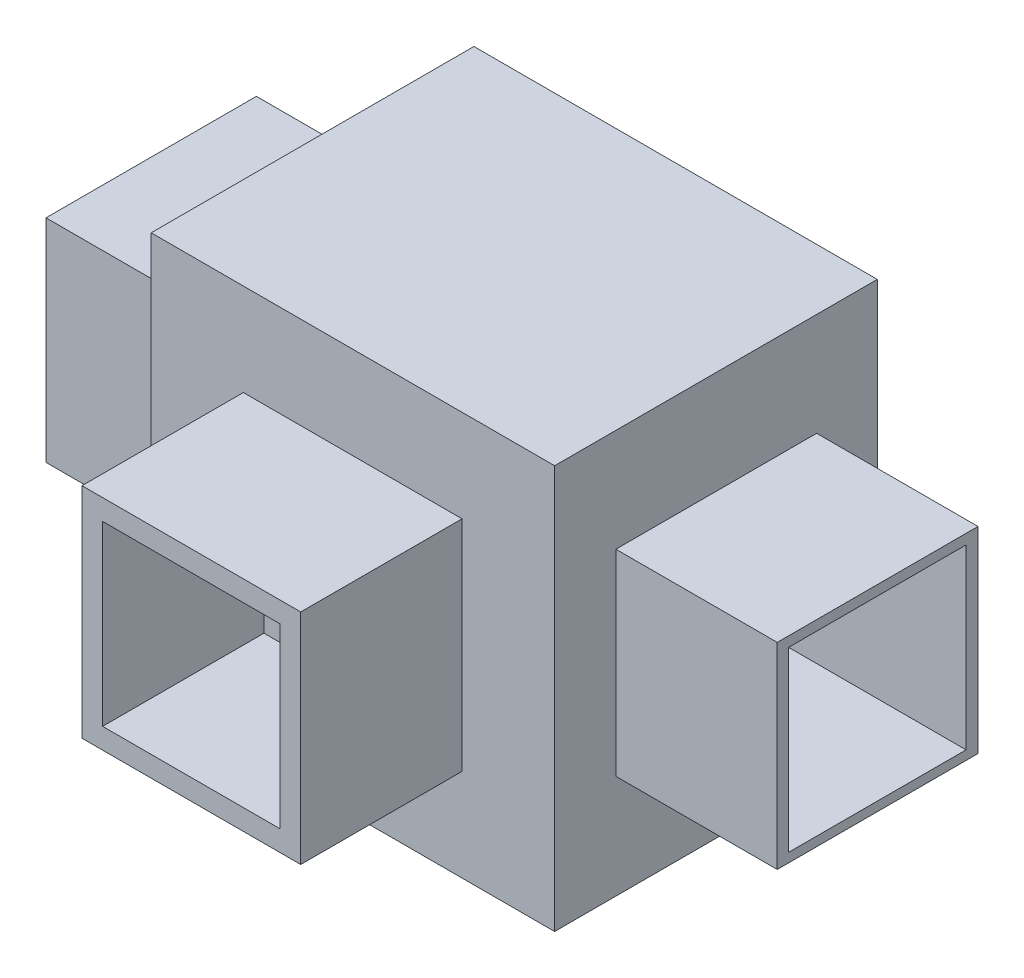
ISO-10303-21;
HEADER;
FILE_DESCRIPTION(('STEP AP214'),'2;1');
FILE_NAME('part.step','',(''),(''),'','','');
FILE_SCHEMA(('AUTOMOTIVE_DESIGN { 1 0 10303 214 1 1 1 1 }'));
ENDSEC;
DATA;
#1=APPLICATION_CONTEXT('core data for automotive mechanical design processes');
#2=APPLICATION_PROTOCOL_DEFINITION('international standard','automotive_design',2000,#1);
#3=PRODUCT_CONTEXT('',#1,'mechanical');
#4=PRODUCT('Part','Part','',(#3));
#5=PRODUCT_RELATED_PRODUCT_CATEGORY('part','',(#4));
#6=PRODUCT_DEFINITION_FORMATION('','',#4);
#7=PRODUCT_DEFINITION_CONTEXT('part definition',#1,'design');
#8=PRODUCT_DEFINITION('design','',#6,#7);
#9=PRODUCT_DEFINITION_SHAPE('','',#8);
#10=(LENGTH_UNIT() NAMED_UNIT(*) SI_UNIT(.MILLI.,.METRE.));
#11=(NAMED_UNIT(*) PLANE_ANGLE_UNIT() SI_UNIT($,.RADIAN.));
#12=(NAMED_UNIT(*) SI_UNIT($,.STERADIAN.) SOLID_ANGLE_UNIT());
#13=UNCERTAINTY_MEASURE_WITH_UNIT(LENGTH_MEASURE(1.E-05),#10,'distance_accuracy_value','');
#14=(GEOMETRIC_REPRESENTATION_CONTEXT(3) GLOBAL_UNCERTAINTY_ASSIGNED_CONTEXT((#13)) GLOBAL_UNIT_ASSIGNED_CONTEXT((#10,
#11,#12)) REPRESENTATION_CONTEXT('',''));
#15=CARTESIAN_POINT('',(0.,0.,0.));
#16=DIRECTION('',(0.,0.,1.));
#17=DIRECTION('',(1.,0.,0.));
#18=AXIS2_PLACEMENT_3D('',#15,#16,#17);
#19=CARTESIAN_POINT('',(-31.2466038441036,21.3932934700663,20.));
#20=DIRECTION('',(-1.,0.,0.));
#21=DIRECTION('',(0.,-1.,0.));
#22=AXIS2_PLACEMENT_3D('',#19,#20,#21);
#23=PLANE('',#22);
#24=DIRECTION('',(0.,0.,-1.));
#25=VECTOR('',#24,1.);
#26=CARTESIAN_POINT('',(-31.2466038441036,-28.6067065299337,20.));
#27=LINE('',#26,#25);
#28=CARTESIAN_POINT('',(-31.2466038441036,-28.6067065299337,20.));
#29=VERTEX_POINT('',#28);
#30=CARTESIAN_POINT('',(-31.2466038441036,-28.6067065299337,-20.));
#31=VERTEX_POINT('',#30);
#32=EDGE_CURVE('E41',#29,#31,#27,.T.);
#33=ORIENTED_EDGE('',*,*,#32,.T.);
#34=DIRECTION('',(0.,-1.,0.));
#35=VECTOR('',#34,1.);
#36=CARTESIAN_POINT('',(-31.2466038441036,21.3932934700663,-20.));
#37=LINE('',#36,#35);
#38=CARTESIAN_POINT('',(-31.2466038441036,21.3932934700663,-20.));
#39=VERTEX_POINT('',#38);
#40=EDGE_CURVE('E293',#39,#31,#37,.T.);
#41=ORIENTED_EDGE('',*,*,#40,.F.);
#42=DIRECTION('',(0.,0.,-1.));
#43=VECTOR('',#42,1.);
#44=CARTESIAN_POINT('',(-31.2466038441036,21.3932934700663,20.));
#45=LINE('',#44,#43);
#46=CARTESIAN_POINT('',(-31.2466038441036,21.3932934700663,20.));
#47=VERTEX_POINT('',#46);
#48=EDGE_CURVE('E374',#47,#39,#45,.T.);
#49=ORIENTED_EDGE('',*,*,#48,.F.);
#50=DIRECTION('',(0.,1.,0.));
#51=VECTOR('',#50,1.);
#52=CARTESIAN_POINT('',(-31.2466038441036,21.3932934700663,20.));
#53=LINE('',#52,#51);
#54=EDGE_CURVE('E368',#29,#47,#53,.T.);
#55=ORIENTED_EDGE('',*,*,#54,.F.);
#56=EDGE_LOOP('',(#33,#41,#49,#55));
#57=FACE_BOUND('',#56,.T.);
#58=DIRECTION('',(0.,-1.,0.));
#59=VECTOR('',#58,1.);
#60=CARTESIAN_POINT('',(-31.2466038441036,8.6331538324913,12.4057740013086));
#61=LINE('',#60,#59);
#62=CARTESIAN_POINT('',(-31.2466038441036,8.6331538324913,12.4057740013086));
#63=VERTEX_POINT('',#62);
#64=CARTESIAN_POINT('',(-31.2466038441036,-15.7456788712302,12.4057740013086));
#65=VERTEX_POINT('',#64);
#66=EDGE_CURVE('E220',#63,#65,#61,.T.);
#67=ORIENTED_EDGE('',*,*,#66,.F.);
#68=DIRECTION('',(0.,0.,1.));
#69=VECTOR('',#68,1.);
#70=CARTESIAN_POINT('',(-31.2466038441036,8.6331538324913,12.4057740013086));
#71=LINE('',#70,#69);
#72=CARTESIAN_POINT('',(-31.2466038441036,8.6331538324913,-12.47859569947));
#73=VERTEX_POINT('',#72);
#74=EDGE_CURVE('E225',#73,#63,#71,.T.);
#75=ORIENTED_EDGE('',*,*,#74,.F.);
#76=DIRECTION('',(0.,1.,0.));
#77=VECTOR('',#76,1.);
#78=CARTESIAN_POINT('',(-31.2466038441036,8.6331538324913,-12.47859569947));
#79=LINE('',#78,#77);
#80=CARTESIAN_POINT('',(-31.2466038441036,-15.7456788712302,-12.47859569947));
#81=VERTEX_POINT('',#80);
#82=EDGE_CURVE('E53',#81,#73,#79,.T.);
#83=ORIENTED_EDGE('',*,*,#82,.F.);
#84=DIRECTION('',(0.,0.,-1.));
#85=VECTOR('',#84,1.);
#86=CARTESIAN_POINT('',(-31.2466038441036,-15.7456788712302,12.4057740013086));
#87=LINE('',#86,#85);
#88=EDGE_CURVE('E48',#65,#81,#87,.T.);
#89=ORIENTED_EDGE('',*,*,#88,.F.);
#90=EDGE_LOOP('',(#67,#75,#83,#89));
#91=FACE_BOUND('',#90,.T.);
#92=ADVANCED_FACE('F33',(#57,#91),#23,.F.);
#93=CARTESIAN_POINT('',(-81.2466038441036,21.3932934700663,20.));
#94=DIRECTION('',(1.,0.,0.));
#95=DIRECTION('',(0.,0.,-1.));
#96=AXIS2_PLACEMENT_3D('',#93,#94,#95);
#97=PLANE('',#96);
#98=DIRECTION('',(0.,0.,-1.));
#99=VECTOR('',#98,1.);
#100=CARTESIAN_POINT('',(-81.2466038441036,21.3932934700663,20.));
#101=LINE('',#100,#99);
#102=CARTESIAN_POINT('',(-81.2466038441036,21.3932934700663,20.));
#103=VERTEX_POINT('',#102);
#104=CARTESIAN_POINT('',(-81.2466038441036,21.3932934700663,-20.));
#105=VERTEX_POINT('',#104);
#106=EDGE_CURVE('E372',#103,#105,#101,.T.);
#107=ORIENTED_EDGE('',*,*,#106,.T.);
#108=DIRECTION('',(0.,1.,0.));
#109=VECTOR('',#108,1.);
#110=CARTESIAN_POINT('',(-81.2466038441036,21.3932934700663,-20.));
#111=LINE('',#110,#109);
#112=CARTESIAN_POINT('',(-81.2466038441036,-28.6067065299337,-20.));
#113=VERTEX_POINT('',#112);
#114=EDGE_CURVE('E299',#113,#105,#111,.T.);
#115=ORIENTED_EDGE('',*,*,#114,.F.);
#116=DIRECTION('',(0.,0.,-1.));
#117=VECTOR('',#116,1.);
#118=CARTESIAN_POINT('',(-81.2466038441036,-28.6067065299337,20.));
#119=LINE('',#118,#117);
#120=CARTESIAN_POINT('',(-81.2466038441036,-28.6067065299337,20.));
#121=VERTEX_POINT('',#120);
#122=EDGE_CURVE('E11',#121,#113,#119,.T.);
#123=ORIENTED_EDGE('',*,*,#122,.F.);
#124=DIRECTION('',(0.,-1.,0.));
#125=VECTOR('',#124,1.);
#126=CARTESIAN_POINT('',(-81.2466038441036,21.3932934700663,20.));
#127=LINE('',#126,#125);
#128=EDGE_CURVE('E363',#103,#121,#127,.T.);
#129=ORIENTED_EDGE('',*,*,#128,.F.);
#130=EDGE_LOOP('',(#107,#115,#123,#129));
#131=FACE_BOUND('',#130,.T.);
#132=DIRECTION('',(0.,1.,0.));
#133=VECTOR('',#132,1.);
#134=CARTESIAN_POINT('',(-81.2466038441036,9.52314430911532,13.0390923407262));
#135=LINE('',#134,#133);
#136=CARTESIAN_POINT('',(-81.2466038441036,-16.7365573689828,13.0390923407262));
#137=VERTEX_POINT('',#136);
#138=CARTESIAN_POINT('',(-81.2466038441036,9.52314430911532,13.0390923407262));
#139=VERTEX_POINT('',#138);
#140=EDGE_CURVE('E260',#137,#139,#135,.T.);
#141=ORIENTED_EDGE('',*,*,#140,.F.);
#142=DIRECTION('',(0.,0.,1.));
#143=VECTOR('',#142,1.);
#144=CARTESIAN_POINT('',(-81.2466038441036,-16.7365573689828,-13.0390923407262));
#145=LINE('',#144,#143);
#146=CARTESIAN_POINT('',(-81.2466038441036,-16.7365573689828,-13.0390923407262));
#147=VERTEX_POINT('',#146);
#148=EDGE_CURVE('E265',#147,#137,#145,.T.);
#149=ORIENTED_EDGE('',*,*,#148,.F.);
#150=DIRECTION('',(0.,-1.,0.));
#151=VECTOR('',#150,1.);
#152=CARTESIAN_POINT('',(-81.2466038441036,9.52314430911532,-13.0390923407262));
#153=LINE('',#152,#151);
#154=CARTESIAN_POINT('',(-81.2466038441036,9.52314430911532,-13.0390923407262));
#155=VERTEX_POINT('',#154);
#156=EDGE_CURVE('E277',#155,#147,#153,.T.);
#157=ORIENTED_EDGE('',*,*,#156,.F.);
#158=DIRECTION('',(0.,0.,-1.));
#159=VECTOR('',#158,1.);
#160=CARTESIAN_POINT('',(-81.2466038441036,9.52314430911532,-13.0390923407262));
#161=LINE('',#160,#159);
#162=EDGE_CURVE('E274',#139,#155,#161,.T.);
#163=ORIENTED_EDGE('',*,*,#162,.F.);
#164=EDGE_LOOP('',(#141,#149,#157,#163));
#165=FACE_BOUND('',#164,.T.);
#166=ADVANCED_FACE('F35',(#131,#165),#97,.F.);
#167=CARTESIAN_POINT('',(0.,0.,20.));
#168=DIRECTION('',(0.,0.,1.));
#169=DIRECTION('',(1.,0.,0.));
#170=AXIS2_PLACEMENT_3D('',#167,#168,#169);
#171=PLANE('',#170);
#172=ORIENTED_EDGE('',*,*,#128,.T.);
#173=DIRECTION('',(1.,0.,0.));
#174=VECTOR('',#173,1.);
#175=CARTESIAN_POINT('',(-81.2466038441036,-28.6067065299337,20.));
#176=LINE('',#175,#174);
#177=EDGE_CURVE('E366',#121,#29,#176,.T.);
#178=ORIENTED_EDGE('',*,*,#177,.T.);
#179=ORIENTED_EDGE('',*,*,#54,.T.);
#180=DIRECTION('',(-1.,0.,0.));
#181=VECTOR('',#180,1.);
#182=CARTESIAN_POINT('',(-81.2466038441036,21.3932934700663,20.));
#183=LINE('',#182,#181);
#184=EDGE_CURVE('E370',#47,#103,#183,.T.);
#185=ORIENTED_EDGE('',*,*,#184,.T.);
#186=EDGE_LOOP('',(#172,#178,#179,#185));
#187=FACE_BOUND('',#186,.T.);
#188=DIRECTION('',(-1.,0.,0.));
#189=VECTOR('',#188,1.);
#190=CARTESIAN_POINT('',(-69.8249239257988,9.96044253707693,20.));
#191=LINE('',#190,#189);
#192=CARTESIAN_POINT('',(-42.7146356064686,9.96044253707693,20.));
#193=VERTEX_POINT('',#192);
#194=CARTESIAN_POINT('',(-69.8249239257988,9.96044253707693,20.));
#195=VERTEX_POINT('',#194);
#196=EDGE_CURVE('E348',#193,#195,#191,.T.);
#197=ORIENTED_EDGE('',*,*,#196,.F.);
#198=DIRECTION('',(0.,1.,0.));
#199=VECTOR('',#198,1.);
#200=CARTESIAN_POINT('',(-42.7146356064686,9.96044253707693,20.));
#201=LINE('',#200,#199);
#202=CARTESIAN_POINT('',(-42.7146356064686,-17.1498457822532,20.));
#203=VERTEX_POINT('',#202);
#204=EDGE_CURVE('E334',#203,#193,#201,.T.);
#205=ORIENTED_EDGE('',*,*,#204,.F.);
#206=DIRECTION('',(1.,0.,0.));
#207=VECTOR('',#206,1.);
#208=CARTESIAN_POINT('',(-69.8249239257988,-17.1498457822532,20.));
#209=LINE('',#208,#207);
#210=CARTESIAN_POINT('',(-69.8249239257988,-17.1498457822532,20.));
#211=VERTEX_POINT('',#210);
#212=EDGE_CURVE('E339',#211,#203,#209,.T.);
#213=ORIENTED_EDGE('',*,*,#212,.F.);
#214=DIRECTION('',(0.,-1.,0.));
#215=VECTOR('',#214,1.);
#216=CARTESIAN_POINT('',(-69.8249239257988,9.96044253707693,20.));
#217=LINE('',#216,#215);
#218=EDGE_CURVE('E350',#195,#211,#217,.T.);
#219=ORIENTED_EDGE('',*,*,#218,.F.);
#220=EDGE_LOOP('',(#197,#205,#213,#219));
#221=FACE_BOUND('',#220,.T.);
#222=ADVANCED_FACE('F394',(#187,#221),#171,.T.);
#223=CARTESIAN_POINT('',(-81.2466038441036,-28.6067065299337,20.));
#224=DIRECTION('',(0.,1.,0.));
#225=DIRECTION('',(0.,0.,1.));
#226=AXIS2_PLACEMENT_3D('',#223,#224,#225);
#227=PLANE('',#226);
#228=ORIENTED_EDGE('',*,*,#122,.T.);
#229=DIRECTION('',(-1.,0.,0.));
#230=VECTOR('',#229,1.);
#231=CARTESIAN_POINT('',(-31.2466038441036,-28.6067065299337,-20.));
#232=LINE('',#231,#230);
#233=EDGE_CURVE('E296',#31,#113,#232,.T.);
#234=ORIENTED_EDGE('',*,*,#233,.F.);
#235=ORIENTED_EDGE('',*,*,#32,.F.);
#236=ORIENTED_EDGE('',*,*,#177,.F.);
#237=EDGE_LOOP('',(#228,#234,#235,#236));
#238=FACE_BOUND('',#237,.T.);
#239=ADVANCED_FACE('F382',(#238),#227,.F.);
#240=CARTESIAN_POINT('',(-81.2466038441036,21.3932934700663,20.));
#241=DIRECTION('',(0.,-1.,0.));
#242=DIRECTION('',(0.,0.,-1.));
#243=AXIS2_PLACEMENT_3D('',#240,#241,#242);
#244=PLANE('',#243);
#245=ORIENTED_EDGE('',*,*,#48,.T.);
#246=DIRECTION('',(1.,0.,0.));
#247=VECTOR('',#246,1.);
#248=CARTESIAN_POINT('',(-31.2466038441036,21.3932934700663,-20.));
#249=LINE('',#248,#247);
#250=EDGE_CURVE('E302',#105,#39,#249,.T.);
#251=ORIENTED_EDGE('',*,*,#250,.F.);
#252=ORIENTED_EDGE('',*,*,#106,.F.);
#253=ORIENTED_EDGE('',*,*,#184,.F.);
#254=EDGE_LOOP('',(#245,#251,#252,#253));
#255=FACE_BOUND('',#254,.T.);
#256=ADVANCED_FACE('F390',(#255),#244,.F.);
#257=CARTESIAN_POINT('',(0.,0.,40.));
#258=DIRECTION('',(0.,0.,1.));
#259=DIRECTION('',(1.,0.,0.));
#260=AXIS2_PLACEMENT_3D('',#257,#258,#259);
#261=PLANE('',#260);
#262=DIRECTION('',(0.,1.,0.));
#263=VECTOR('',#262,1.);
#264=CARTESIAN_POINT('',(-42.7146356064686,9.96044253707693,40.));
#265=LINE('',#264,#263);
#266=CARTESIAN_POINT('',(-42.7146356064686,-17.1498457822532,40.));
#267=VERTEX_POINT('',#266);
#268=CARTESIAN_POINT('',(-42.7146356064686,9.96044253707693,40.));
#269=VERTEX_POINT('',#268);
#270=EDGE_CURVE('E335',#267,#269,#265,.T.);
#271=ORIENTED_EDGE('',*,*,#270,.T.);
#272=DIRECTION('',(-1.,0.,0.));
#273=VECTOR('',#272,1.);
#274=CARTESIAN_POINT('',(-69.8249239257988,9.96044253707693,40.));
#275=LINE('',#274,#273);
#276=CARTESIAN_POINT('',(-69.8249239257988,9.96044253707693,40.));
#277=VERTEX_POINT('',#276);
#278=EDGE_CURVE('E338',#269,#277,#275,.T.);
#279=ORIENTED_EDGE('',*,*,#278,.T.);
#280=DIRECTION('',(0.,-1.,0.));
#281=VECTOR('',#280,1.);
#282=CARTESIAN_POINT('',(-69.8249239257988,9.96044253707693,40.));
#283=LINE('',#282,#281);
#284=CARTESIAN_POINT('',(-69.8249239257988,-17.1498457822532,40.));
#285=VERTEX_POINT('',#284);
#286=EDGE_CURVE('E341',#277,#285,#283,.T.);
#287=ORIENTED_EDGE('',*,*,#286,.T.);
#288=DIRECTION('',(1.,0.,0.));
#289=VECTOR('',#288,1.);
#290=CARTESIAN_POINT('',(-69.8249239257988,-17.1498457822532,40.));
#291=LINE('',#290,#289);
#292=EDGE_CURVE('E343',#285,#267,#291,.T.);
#293=ORIENTED_EDGE('',*,*,#292,.T.);
#294=EDGE_LOOP('',(#271,#279,#287,#293));
#295=FACE_BOUND('',#294,.T.);
#296=DIRECTION('',(-1.,0.,0.));
#297=VECTOR('',#296,1.);
#298=CARTESIAN_POINT('',(-67.2697797661337,7.40529837741184,40.));
#299=LINE('',#298,#297);
#300=CARTESIAN_POINT('',(-45.2697797661337,7.40529837741185,40.));
#301=VERTEX_POINT('',#300);
#302=CARTESIAN_POINT('',(-67.2697797661337,7.40529837741184,40.));
#303=VERTEX_POINT('',#302);
#304=EDGE_CURVE('E308',#301,#303,#299,.T.);
#305=ORIENTED_EDGE('',*,*,#304,.F.);
#306=DIRECTION('',(0.,1.,0.));
#307=VECTOR('',#306,1.);
#308=CARTESIAN_POINT('',(-45.2697797661337,7.40529837741185,40.));
#309=LINE('',#308,#307);
#310=CARTESIAN_POINT('',(-45.2697797661337,-14.5947016225882,40.));
#311=VERTEX_POINT('',#310);
#312=EDGE_CURVE('E306',#311,#301,#309,.T.);
#313=ORIENTED_EDGE('',*,*,#312,.F.);
#314=DIRECTION('',(1.,0.,0.));
#315=VECTOR('',#314,1.);
#316=CARTESIAN_POINT('',(-67.2697797661337,-14.5947016225882,40.));
#317=LINE('',#316,#315);
#318=CARTESIAN_POINT('',(-67.2697797661337,-14.5947016225882,40.));
#319=VERTEX_POINT('',#318);
#320=EDGE_CURVE('E314',#319,#311,#317,.T.);
#321=ORIENTED_EDGE('',*,*,#320,.F.);
#322=DIRECTION('',(0.,-1.,0.));
#323=VECTOR('',#322,1.);
#324=CARTESIAN_POINT('',(-67.2697797661337,7.40529837741184,40.));
#325=LINE('',#324,#323);
#326=EDGE_CURVE('E311',#303,#319,#325,.T.);
#327=ORIENTED_EDGE('',*,*,#326,.F.);
#328=EDGE_LOOP('',(#305,#313,#321,#327));
#329=FACE_BOUND('',#328,.T.);
#330=ADVANCED_FACE('F436',(#295,#329),#261,.T.);
#331=CARTESIAN_POINT('',(-42.7146356064686,9.96044253707693,40.));
#332=DIRECTION('',(-1.,0.,0.));
#333=DIRECTION('',(0.,0.,1.));
#334=AXIS2_PLACEMENT_3D('',#331,#332,#333);
#335=PLANE('',#334);
#336=ORIENTED_EDGE('',*,*,#204,.T.);
#337=DIRECTION('',(0.,0.,-1.));
#338=VECTOR('',#337,1.);
#339=CARTESIAN_POINT('',(-42.7146356064686,9.96044253707693,40.));
#340=LINE('',#339,#338);
#341=EDGE_CURVE('E361',#269,#193,#340,.T.);
#342=ORIENTED_EDGE('',*,*,#341,.F.);
#343=ORIENTED_EDGE('',*,*,#270,.F.);
#344=DIRECTION('',(0.,0.,-1.));
#345=VECTOR('',#344,1.);
#346=CARTESIAN_POINT('',(-42.7146356064686,-17.1498457822532,40.));
#347=LINE('',#346,#345);
#348=EDGE_CURVE('E345',#267,#203,#347,.T.);
#349=ORIENTED_EDGE('',*,*,#348,.T.);
#350=EDGE_LOOP('',(#336,#342,#343,#349));
#351=FACE_BOUND('',#350,.T.);
#352=ADVANCED_FACE('F481',(#351),#335,.F.);
#353=CARTESIAN_POINT('',(-69.8249239257988,9.96044253707693,40.));
#354=DIRECTION('',(0.,-1.,0.));
#355=DIRECTION('',(0.,0.,-1.));
#356=AXIS2_PLACEMENT_3D('',#353,#354,#355);
#357=PLANE('',#356);
#358=ORIENTED_EDGE('',*,*,#196,.T.);
#359=DIRECTION('',(0.,0.,-1.));
#360=VECTOR('',#359,1.);
#361=CARTESIAN_POINT('',(-69.8249239257988,9.96044253707693,40.));
#362=LINE('',#361,#360);
#363=EDGE_CURVE('E358',#277,#195,#362,.T.);
#364=ORIENTED_EDGE('',*,*,#363,.F.);
#365=ORIENTED_EDGE('',*,*,#278,.F.);
#366=ORIENTED_EDGE('',*,*,#341,.T.);
#367=EDGE_LOOP('',(#358,#364,#365,#366));
#368=FACE_BOUND('',#367,.T.);
#369=ADVANCED_FACE('F489',(#368),#357,.F.);
#370=CARTESIAN_POINT('',(-69.8249239257988,9.96044253707693,40.));
#371=DIRECTION('',(1.,0.,0.));
#372=DIRECTION('',(0.,0.,-1.));
#373=AXIS2_PLACEMENT_3D('',#370,#371,#372);
#374=PLANE('',#373);
#375=ORIENTED_EDGE('',*,*,#218,.T.);
#376=DIRECTION('',(0.,0.,-1.));
#377=VECTOR('',#376,1.);
#378=CARTESIAN_POINT('',(-69.8249239257988,-17.1498457822532,40.));
#379=LINE('',#378,#377);
#380=EDGE_CURVE('E356',#285,#211,#379,.T.);
#381=ORIENTED_EDGE('',*,*,#380,.F.);
#382=ORIENTED_EDGE('',*,*,#286,.F.);
#383=ORIENTED_EDGE('',*,*,#363,.T.);
#384=EDGE_LOOP('',(#375,#381,#382,#383));
#385=FACE_BOUND('',#384,.T.);
#386=ADVANCED_FACE('F485',(#385),#374,.F.);
#387=CARTESIAN_POINT('',(-69.8249239257988,-17.1498457822532,40.));
#388=DIRECTION('',(0.,1.,0.));
#389=DIRECTION('',(0.,0.,1.));
#390=AXIS2_PLACEMENT_3D('',#387,#388,#389);
#391=PLANE('',#390);
#392=ORIENTED_EDGE('',*,*,#212,.T.);
#393=ORIENTED_EDGE('',*,*,#348,.F.);
#394=ORIENTED_EDGE('',*,*,#292,.F.);
#395=ORIENTED_EDGE('',*,*,#380,.T.);
#396=EDGE_LOOP('',(#392,#393,#394,#395));
#397=FACE_BOUND('',#396,.T.);
#398=ADVANCED_FACE('F478',(#397),#391,.F.);
#399=CARTESIAN_POINT('',(-45.2697797661337,7.40529837741185,40.));
#400=DIRECTION('',(-1.,0.,0.));
#401=DIRECTION('',(0.,0.,1.));
#402=AXIS2_PLACEMENT_3D('',#399,#400,#401);
#403=PLANE('',#402);
#404=DIRECTION('',(0.,1.,0.));
#405=VECTOR('',#404,1.);
#406=CARTESIAN_POINT('',(-45.2697797661337,7.40529837741185,20.));
#407=LINE('',#406,#405);
#408=CARTESIAN_POINT('',(-45.2697797661337,-14.5947016225882,20.));
#409=VERTEX_POINT('',#408);
#410=CARTESIAN_POINT('',(-45.2697797661337,7.40529837741185,20.));
#411=VERTEX_POINT('',#410);
#412=EDGE_CURVE('E305',#409,#411,#407,.T.);
#413=ORIENTED_EDGE('',*,*,#412,.F.);
#414=DIRECTION('',(0.,0.,-1.));
#415=VECTOR('',#414,1.);
#416=CARTESIAN_POINT('',(-45.2697797661337,-14.5947016225882,40.));
#417=LINE('',#416,#415);
#418=EDGE_CURVE('E316',#311,#409,#417,.T.);
#419=ORIENTED_EDGE('',*,*,#418,.F.);
#420=ORIENTED_EDGE('',*,*,#312,.T.);
#421=DIRECTION('',(0.,0.,-1.));
#422=VECTOR('',#421,1.);
#423=CARTESIAN_POINT('',(-45.2697797661337,7.40529837741185,40.));
#424=LINE('',#423,#422);
#425=EDGE_CURVE('E331',#301,#411,#424,.T.);
#426=ORIENTED_EDGE('',*,*,#425,.T.);
#427=EDGE_LOOP('',(#413,#419,#420,#426));
#428=FACE_BOUND('',#427,.T.);
#429=ADVANCED_FACE('F463',(#428),#403,.T.);
#430=CARTESIAN_POINT('',(-67.2697797661337,7.40529837741184,40.));
#431=DIRECTION('',(0.,-1.,0.));
#432=DIRECTION('',(1.,0.,0.));
#433=AXIS2_PLACEMENT_3D('',#430,#431,#432);
#434=PLANE('',#433);
#435=DIRECTION('',(-1.,0.,0.));
#436=VECTOR('',#435,1.);
#437=CARTESIAN_POINT('',(-67.2697797661337,7.40529837741184,20.));
#438=LINE('',#437,#436);
#439=CARTESIAN_POINT('',(-67.2697797661337,7.40529837741184,20.));
#440=VERTEX_POINT('',#439);
#441=EDGE_CURVE('E318',#411,#440,#438,.T.);
#442=ORIENTED_EDGE('',*,*,#441,.F.);
#443=ORIENTED_EDGE('',*,*,#425,.F.);
#444=ORIENTED_EDGE('',*,*,#304,.T.);
#445=DIRECTION('',(0.,0.,-1.));
#446=VECTOR('',#445,1.);
#447=CARTESIAN_POINT('',(-67.2697797661337,7.40529837741184,40.));
#448=LINE('',#447,#446);
#449=EDGE_CURVE('E328',#303,#440,#448,.T.);
#450=ORIENTED_EDGE('',*,*,#449,.T.);
#451=EDGE_LOOP('',(#442,#443,#444,#450));
#452=FACE_BOUND('',#451,.T.);
#453=ADVANCED_FACE('F459',(#452),#434,.T.);
#454=CARTESIAN_POINT('',(-67.2697797661337,7.40529837741184,40.));
#455=DIRECTION('',(1.,0.,0.));
#456=DIRECTION('',(0.,1.,0.));
#457=AXIS2_PLACEMENT_3D('',#454,#455,#456);
#458=PLANE('',#457);
#459=DIRECTION('',(0.,-1.,0.));
#460=VECTOR('',#459,1.);
#461=CARTESIAN_POINT('',(-67.2697797661337,7.40529837741184,20.));
#462=LINE('',#461,#460);
#463=CARTESIAN_POINT('',(-67.2697797661337,-14.5947016225882,20.));
#464=VERTEX_POINT('',#463);
#465=EDGE_CURVE('E320',#440,#464,#462,.T.);
#466=ORIENTED_EDGE('',*,*,#465,.F.);
#467=ORIENTED_EDGE('',*,*,#449,.F.);
#468=ORIENTED_EDGE('',*,*,#326,.T.);
#469=DIRECTION('',(0.,0.,-1.));
#470=VECTOR('',#469,1.);
#471=CARTESIAN_POINT('',(-67.2697797661337,-14.5947016225882,40.));
#472=LINE('',#471,#470);
#473=EDGE_CURVE('E325',#319,#464,#472,.T.);
#474=ORIENTED_EDGE('',*,*,#473,.T.);
#475=EDGE_LOOP('',(#466,#467,#468,#474));
#476=FACE_BOUND('',#475,.T.);
#477=ADVANCED_FACE('F449',(#476),#458,.T.);
#478=CARTESIAN_POINT('',(-67.2697797661337,-14.5947016225882,40.));
#479=DIRECTION('',(0.,1.,0.));
#480=DIRECTION('',(0.,0.,1.));
#481=AXIS2_PLACEMENT_3D('',#478,#479,#480);
#482=PLANE('',#481);
#483=DIRECTION('',(1.,0.,0.));
#484=VECTOR('',#483,1.);
#485=CARTESIAN_POINT('',(-67.2697797661337,-14.5947016225882,20.));
#486=LINE('',#485,#484);
#487=EDGE_CURVE('E309',#464,#409,#486,.T.);
#488=ORIENTED_EDGE('',*,*,#487,.F.);
#489=ORIENTED_EDGE('',*,*,#473,.F.);
#490=ORIENTED_EDGE('',*,*,#320,.T.);
#491=ORIENTED_EDGE('',*,*,#418,.T.);
#492=EDGE_LOOP('',(#488,#489,#490,#491));
#493=FACE_BOUND('',#492,.T.);
#494=ADVANCED_FACE('F442',(#493),#482,.T.);
#495=ORIENTED_EDGE('',*,*,#412,.T.);
#496=ORIENTED_EDGE('',*,*,#441,.T.);
#497=ORIENTED_EDGE('',*,*,#465,.T.);
#498=ORIENTED_EDGE('',*,*,#487,.T.);
#499=EDGE_LOOP('',(#495,#496,#497,#498));
#500=FACE_BOUND('',#499,.T.);
#501=ADVANCED_FACE('F437',(#500),#171,.T.);
#502=CARTESIAN_POINT('',(0.,0.,-20.));
#503=DIRECTION('',(0.,0.,-1.));
#504=DIRECTION('',(-1.,0.,0.));
#505=AXIS2_PLACEMENT_3D('',#502,#503,#504);
#506=PLANE('',#505);
#507=ORIENTED_EDGE('',*,*,#40,.T.);
#508=ORIENTED_EDGE('',*,*,#233,.T.);
#509=ORIENTED_EDGE('',*,*,#114,.T.);
#510=ORIENTED_EDGE('',*,*,#250,.T.);
#511=EDGE_LOOP('',(#507,#508,#509,#510));
#512=FACE_BOUND('',#511,.T.);
#513=ADVANCED_FACE('F386',(#512),#506,.T.);
#514=CARTESIAN_POINT('',(-101.246603844104,0.,0.));
#515=DIRECTION('',(-1.,0.,0.));
#516=DIRECTION('',(0.,0.,1.));
#517=AXIS2_PLACEMENT_3D('',#514,#515,#516);
#518=PLANE('',#517);
#519=DIRECTION('',(0.,1.,0.));
#520=VECTOR('',#519,1.);
#521=CARTESIAN_POINT('',(-101.246603844104,9.52314430911532,13.0390923407262));
#522=LINE('',#521,#520);
#523=CARTESIAN_POINT('',(-101.246603844104,-16.7365573689828,13.0390923407262));
#524=VERTEX_POINT('',#523);
#525=CARTESIAN_POINT('',(-101.246603844104,9.52314430911532,13.0390923407262));
#526=VERTEX_POINT('',#525);
#527=EDGE_CURVE('E261',#524,#526,#522,.T.);
#528=ORIENTED_EDGE('',*,*,#527,.T.);
#529=DIRECTION('',(0.,0.,-1.));
#530=VECTOR('',#529,1.);
#531=CARTESIAN_POINT('',(-101.246603844104,9.52314430911532,-13.0390923407262));
#532=LINE('',#531,#530);
#533=CARTESIAN_POINT('',(-101.246603844104,9.52314430911532,-13.0390923407262));
#534=VERTEX_POINT('',#533);
#535=EDGE_CURVE('E264',#526,#534,#532,.T.);
#536=ORIENTED_EDGE('',*,*,#535,.T.);
#537=DIRECTION('',(0.,-1.,0.));
#538=VECTOR('',#537,1.);
#539=CARTESIAN_POINT('',(-101.246603844104,9.52314430911532,-13.0390923407262));
#540=LINE('',#539,#538);
#541=CARTESIAN_POINT('',(-101.246603844104,-16.7365573689828,-13.0390923407262));
#542=VERTEX_POINT('',#541);
#543=EDGE_CURVE('E267',#534,#542,#540,.T.);
#544=ORIENTED_EDGE('',*,*,#543,.T.);
#545=DIRECTION('',(0.,0.,1.));
#546=VECTOR('',#545,1.);
#547=CARTESIAN_POINT('',(-101.246603844104,-16.7365573689828,-13.0390923407262));
#548=LINE('',#547,#546);
#549=EDGE_CURVE('E269',#542,#524,#548,.T.);
#550=ORIENTED_EDGE('',*,*,#549,.T.);
#551=EDGE_LOOP('',(#528,#536,#544,#550));
#552=FACE_BOUND('',#551,.T.);
#553=DIRECTION('',(0.,0.,-1.));
#554=VECTOR('',#553,1.);
#555=CARTESIAN_POINT('',(-101.246603844104,7.39329347006625,-11.));
#556=LINE('',#555,#554);
#557=CARTESIAN_POINT('',(-101.246603844104,7.39329347006625,11.));
#558=VERTEX_POINT('',#557);
#559=CARTESIAN_POINT('',(-101.246603844104,7.39329347006625,-11.));
#560=VERTEX_POINT('',#559);
#561=EDGE_CURVE('E250',#558,#560,#556,.T.);
#562=ORIENTED_EDGE('',*,*,#561,.F.);
#563=DIRECTION('',(0.,1.,0.));
#564=VECTOR('',#563,1.);
#565=CARTESIAN_POINT('',(-101.246603844104,7.39329347006625,11.));
#566=LINE('',#565,#564);
#567=CARTESIAN_POINT('',(-101.246603844104,-14.6067065299337,11.));
#568=VERTEX_POINT('',#567);
#569=EDGE_CURVE('E248',#568,#558,#566,.T.);
#570=ORIENTED_EDGE('',*,*,#569,.F.);
#571=DIRECTION('',(0.,0.,1.));
#572=VECTOR('',#571,1.);
#573=CARTESIAN_POINT('',(-101.246603844104,-14.6067065299337,-11.));
#574=LINE('',#573,#572);
#575=CARTESIAN_POINT('',(-101.246603844104,-14.6067065299337,-11.));
#576=VERTEX_POINT('',#575);
#577=EDGE_CURVE('E198',#576,#568,#574,.T.);
#578=ORIENTED_EDGE('',*,*,#577,.F.);
#579=DIRECTION('',(0.,-1.,0.));
#580=VECTOR('',#579,1.);
#581=CARTESIAN_POINT('',(-101.246603844104,7.39329347006625,-11.));
#582=LINE('',#581,#580);
#583=EDGE_CURVE('E252',#560,#576,#582,.T.);
#584=ORIENTED_EDGE('',*,*,#583,.F.);
#585=EDGE_LOOP('',(#562,#570,#578,#584));
#586=FACE_BOUND('',#585,.T.);
#587=ADVANCED_FACE('F409',(#552,#586),#518,.T.);
#588=CARTESIAN_POINT('',(-101.246603844104,9.52314430911532,13.0390923407262));
#589=DIRECTION('',(0.,0.,-1.));
#590=DIRECTION('',(-1.,0.,0.));
#591=AXIS2_PLACEMENT_3D('',#588,#589,#590);
#592=PLANE('',#591);
#593=ORIENTED_EDGE('',*,*,#140,.T.);
#594=DIRECTION('',(1.,0.,0.));
#595=VECTOR('',#594,1.);
#596=CARTESIAN_POINT('',(-101.246603844104,9.52314430911532,13.0390923407262));
#597=LINE('',#596,#595);
#598=EDGE_CURVE('E290',#526,#139,#597,.T.);
#599=ORIENTED_EDGE('',*,*,#598,.F.);
#600=ORIENTED_EDGE('',*,*,#527,.F.);
#601=DIRECTION('',(1.,0.,0.));
#602=VECTOR('',#601,1.);
#603=CARTESIAN_POINT('',(-101.246603844104,-16.7365573689828,13.0390923407262));
#604=LINE('',#603,#602);
#605=EDGE_CURVE('E271',#524,#137,#604,.T.);
#606=ORIENTED_EDGE('',*,*,#605,.T.);
#607=EDGE_LOOP('',(#593,#599,#600,#606));
#608=FACE_BOUND('',#607,.T.);
#609=ADVANCED_FACE('F407',(#608),#592,.F.);
#610=CARTESIAN_POINT('',(-101.246603844104,9.52314430911532,-13.0390923407262));
#611=DIRECTION('',(0.,-1.,0.));
#612=DIRECTION('',(0.,0.,-1.));
#613=AXIS2_PLACEMENT_3D('',#610,#611,#612);
#614=PLANE('',#613);
#615=ORIENTED_EDGE('',*,*,#162,.T.);
#616=DIRECTION('',(1.,0.,0.));
#617=VECTOR('',#616,1.);
#618=CARTESIAN_POINT('',(-101.246603844104,9.52314430911532,-13.0390923407262));
#619=LINE('',#618,#617);
#620=EDGE_CURVE('E287',#534,#155,#619,.T.);
#621=ORIENTED_EDGE('',*,*,#620,.F.);
#622=ORIENTED_EDGE('',*,*,#535,.F.);
#623=ORIENTED_EDGE('',*,*,#598,.T.);
#624=EDGE_LOOP('',(#615,#621,#622,#623));
#625=FACE_BOUND('',#624,.T.);
#626=ADVANCED_FACE('F416',(#625),#614,.F.);
#627=CARTESIAN_POINT('',(-101.246603844104,9.52314430911532,-13.0390923407262));
#628=DIRECTION('',(0.,0.,1.));
#629=DIRECTION('',(1.,0.,0.));
#630=AXIS2_PLACEMENT_3D('',#627,#628,#629);
#631=PLANE('',#630);
#632=ORIENTED_EDGE('',*,*,#156,.T.);
#633=DIRECTION('',(1.,0.,0.));
#634=VECTOR('',#633,1.);
#635=CARTESIAN_POINT('',(-101.246603844104,-16.7365573689828,-13.0390923407262));
#636=LINE('',#635,#634);
#637=EDGE_CURVE('E284',#542,#147,#636,.T.);
#638=ORIENTED_EDGE('',*,*,#637,.F.);
#639=ORIENTED_EDGE('',*,*,#543,.F.);
#640=ORIENTED_EDGE('',*,*,#620,.T.);
#641=EDGE_LOOP('',(#632,#638,#639,#640));
#642=FACE_BOUND('',#641,.T.);
#643=ADVANCED_FACE('F414',(#642),#631,.F.);
#644=CARTESIAN_POINT('',(-101.246603844104,-16.7365573689828,-13.0390923407262));
#645=DIRECTION('',(0.,1.,0.));
#646=DIRECTION('',(0.,0.,1.));
#647=AXIS2_PLACEMENT_3D('',#644,#645,#646);
#648=PLANE('',#647);
#649=ORIENTED_EDGE('',*,*,#148,.T.);
#650=ORIENTED_EDGE('',*,*,#605,.F.);
#651=ORIENTED_EDGE('',*,*,#549,.F.);
#652=ORIENTED_EDGE('',*,*,#637,.T.);
#653=EDGE_LOOP('',(#649,#650,#651,#652));
#654=FACE_BOUND('',#653,.T.);
#655=ADVANCED_FACE('F403',(#654),#648,.F.);
#656=CARTESIAN_POINT('',(-101.246603844104,7.39329347006625,11.));
#657=DIRECTION('',(0.,0.,-1.));
#658=DIRECTION('',(0.,1.,0.));
#659=AXIS2_PLACEMENT_3D('',#656,#657,#658);
#660=PLANE('',#659);
#661=DIRECTION('',(1.,0.,0.));
#662=VECTOR('',#661,1.);
#663=CARTESIAN_POINT('',(-101.246603844104,7.39329347006625,11.));
#664=LINE('',#663,#662);
#665=CARTESIAN_POINT('',(-11.2466038441036,7.39329347006626,11.));
#666=VERTEX_POINT('',#665);
#667=EDGE_CURVE('E207',#558,#666,#664,.T.);
#668=ORIENTED_EDGE('',*,*,#667,.T.);
#669=DIRECTION('',(0.,-1.,0.));
#670=VECTOR('',#669,1.);
#671=CARTESIAN_POINT('',(-11.2466038441036,7.39329347006626,11.));
#672=LINE('',#671,#670);
#673=CARTESIAN_POINT('',(-11.2466038441036,-14.6067065299337,11.));
#674=VERTEX_POINT('',#673);
#675=EDGE_CURVE('E204',#666,#674,#672,.T.);
#676=ORIENTED_EDGE('',*,*,#675,.T.);
#677=DIRECTION('',(1.,0.,0.));
#678=VECTOR('',#677,1.);
#679=CARTESIAN_POINT('',(-101.246603844104,-14.6067065299337,11.));
#680=LINE('',#679,#678);
#681=EDGE_CURVE('E191',#568,#674,#680,.T.);
#682=ORIENTED_EDGE('',*,*,#681,.F.);
#683=ORIENTED_EDGE('',*,*,#569,.T.);
#684=EDGE_LOOP('',(#668,#676,#682,#683));
#685=FACE_BOUND('',#684,.T.);
#686=ADVANCED_FACE('F205',(#685),#660,.T.);
#687=CARTESIAN_POINT('',(-101.246603844104,7.39329347006625,-11.));
#688=DIRECTION('',(0.,-1.,0.));
#689=DIRECTION('',(0.,0.,-1.));
#690=AXIS2_PLACEMENT_3D('',#687,#688,#689);
#691=PLANE('',#690);
#692=DIRECTION('',(1.,0.,0.));
#693=VECTOR('',#692,1.);
#694=CARTESIAN_POINT('',(-101.246603844104,7.39329347006625,-11.));
#695=LINE('',#694,#693);
#696=CARTESIAN_POINT('',(-11.2466038441036,7.39329347006626,-11.));
#697=VERTEX_POINT('',#696);
#698=EDGE_CURVE('E257',#560,#697,#695,.T.);
#699=ORIENTED_EDGE('',*,*,#698,.T.);
#700=DIRECTION('',(0.,0.,1.));
#701=VECTOR('',#700,1.);
#702=CARTESIAN_POINT('',(-11.2466038441036,7.39329347006626,11.));
#703=LINE('',#702,#701);
#704=EDGE_CURVE('E216',#697,#666,#703,.T.);
#705=ORIENTED_EDGE('',*,*,#704,.T.);
#706=ORIENTED_EDGE('',*,*,#667,.F.);
#707=ORIENTED_EDGE('',*,*,#561,.T.);
#708=EDGE_LOOP('',(#699,#705,#706,#707));
#709=FACE_BOUND('',#708,.T.);
#710=ADVANCED_FACE('F617',(#709),#691,.T.);
#711=CARTESIAN_POINT('',(-101.246603844104,7.39329347006625,-11.));
#712=DIRECTION('',(0.,0.,1.));
#713=DIRECTION('',(0.,-1.,0.));
#714=AXIS2_PLACEMENT_3D('',#711,#712,#713);
#715=PLANE('',#714);
#716=DIRECTION('',(1.,0.,0.));
#717=VECTOR('',#716,1.);
#718=CARTESIAN_POINT('',(-101.246603844104,-14.6067065299337,-11.));
#719=LINE('',#718,#717);
#720=CARTESIAN_POINT('',(-11.2466038441036,-14.6067065299337,-11.));
#721=VERTEX_POINT('',#720);
#722=EDGE_CURVE('E201',#576,#721,#719,.T.);
#723=ORIENTED_EDGE('',*,*,#722,.T.);
#724=DIRECTION('',(0.,1.,0.));
#725=VECTOR('',#724,1.);
#726=CARTESIAN_POINT('',(-11.2466038441036,7.39329347006626,-11.));
#727=LINE('',#726,#725);
#728=EDGE_CURVE('E214',#721,#697,#727,.T.);
#729=ORIENTED_EDGE('',*,*,#728,.T.);
#730=ORIENTED_EDGE('',*,*,#698,.F.);
#731=ORIENTED_EDGE('',*,*,#583,.T.);
#732=EDGE_LOOP('',(#723,#729,#730,#731));
#733=FACE_BOUND('',#732,.T.);
#734=ADVANCED_FACE('F627',(#733),#715,.T.);
#735=CARTESIAN_POINT('',(-101.246603844104,-14.6067065299337,-11.));
#736=DIRECTION('',(0.,1.,0.));
#737=DIRECTION('',(0.,0.,1.));
#738=AXIS2_PLACEMENT_3D('',#735,#736,#737);
#739=PLANE('',#738);
#740=ORIENTED_EDGE('',*,*,#681,.T.);
#741=DIRECTION('',(0.,0.,-1.));
#742=VECTOR('',#741,1.);
#743=CARTESIAN_POINT('',(-11.2466038441036,-14.6067065299337,11.));
#744=LINE('',#743,#742);
#745=EDGE_CURVE('E195',#674,#721,#744,.T.);
#746=ORIENTED_EDGE('',*,*,#745,.T.);
#747=ORIENTED_EDGE('',*,*,#722,.F.);
#748=ORIENTED_EDGE('',*,*,#577,.T.);
#749=EDGE_LOOP('',(#740,#746,#747,#748));
#750=FACE_BOUND('',#749,.T.);
#751=ADVANCED_FACE('F193',(#750),#739,.T.);
#752=CARTESIAN_POINT('',(-11.2466038441036,0.,0.));
#753=DIRECTION('',(1.,0.,0.));
#754=DIRECTION('',(0.,1.,0.));
#755=AXIS2_PLACEMENT_3D('',#752,#753,#754);
#756=PLANE('',#755);
#757=DIRECTION('',(0.,-1.,0.));
#758=VECTOR('',#757,1.);
#759=CARTESIAN_POINT('',(-11.2466038441036,8.6331538324913,12.4057740013086));
#760=LINE('',#759,#758);
#761=CARTESIAN_POINT('',(-11.2466038441036,8.6331538324913,12.4057740013086));
#762=VERTEX_POINT('',#761);
#763=CARTESIAN_POINT('',(-11.2466038441036,-15.7456788712302,12.4057740013086));
#764=VERTEX_POINT('',#763);
#765=EDGE_CURVE('E221',#762,#764,#760,.T.);
#766=ORIENTED_EDGE('',*,*,#765,.T.);
#767=DIRECTION('',(0.,0.,-1.));
#768=VECTOR('',#767,1.);
#769=CARTESIAN_POINT('',(-11.2466038441036,-15.7456788712302,12.4057740013086));
#770=LINE('',#769,#768);
#771=CARTESIAN_POINT('',(-11.2466038441036,-15.7456788712302,-12.47859569947));
#772=VERTEX_POINT('',#771);
#773=EDGE_CURVE('E224',#764,#772,#770,.T.);
#774=ORIENTED_EDGE('',*,*,#773,.T.);
#775=DIRECTION('',(0.,1.,0.));
#776=VECTOR('',#775,1.);
#777=CARTESIAN_POINT('',(-11.2466038441036,8.6331538324913,-12.47859569947));
#778=LINE('',#777,#776);
#779=CARTESIAN_POINT('',(-11.2466038441036,8.6331538324913,-12.47859569947));
#780=VERTEX_POINT('',#779);
#781=EDGE_CURVE('E227',#772,#780,#778,.T.);
#782=ORIENTED_EDGE('',*,*,#781,.T.);
#783=DIRECTION('',(0.,0.,1.));
#784=VECTOR('',#783,1.);
#785=CARTESIAN_POINT('',(-11.2466038441036,8.6331538324913,12.4057740013086));
#786=LINE('',#785,#784);
#787=EDGE_CURVE('E229',#780,#762,#786,.T.);
#788=ORIENTED_EDGE('',*,*,#787,.T.);
#789=EDGE_LOOP('',(#766,#774,#782,#788));
#790=FACE_BOUND('',#789,.T.);
#791=ORIENTED_EDGE('',*,*,#745,.F.);
#792=ORIENTED_EDGE('',*,*,#675,.F.);
#793=ORIENTED_EDGE('',*,*,#704,.F.);
#794=ORIENTED_EDGE('',*,*,#728,.F.);
#795=EDGE_LOOP('',(#791,#792,#793,#794));
#796=FACE_BOUND('',#795,.T.);
#797=ADVANCED_FACE('F212',(#790,#796),#756,.T.);
#798=CARTESIAN_POINT('',(-11.2466038441036,8.6331538324913,12.4057740013086));
#799=DIRECTION('',(0.,0.,-1.));
#800=DIRECTION('',(-1.,0.,0.));
#801=AXIS2_PLACEMENT_3D('',#798,#799,#800);
#802=PLANE('',#801);
#803=ORIENTED_EDGE('',*,*,#66,.T.);
#804=DIRECTION('',(-1.,0.,0.));
#805=VECTOR('',#804,1.);
#806=CARTESIAN_POINT('',(-11.2466038441036,-15.7456788712302,12.4057740013086));
#807=LINE('',#806,#805);
#808=EDGE_CURVE('E246',#764,#65,#807,.T.);
#809=ORIENTED_EDGE('',*,*,#808,.F.);
#810=ORIENTED_EDGE('',*,*,#765,.F.);
#811=DIRECTION('',(-1.,0.,0.));
#812=VECTOR('',#811,1.);
#813=CARTESIAN_POINT('',(-11.2466038441036,8.6331538324913,12.4057740013086));
#814=LINE('',#813,#812);
#815=EDGE_CURVE('E231',#762,#63,#814,.T.);
#816=ORIENTED_EDGE('',*,*,#815,.T.);
#817=EDGE_LOOP('',(#803,#809,#810,#816));
#818=FACE_BOUND('',#817,.T.);
#819=ADVANCED_FACE('F657',(#818),#802,.F.);
#820=CARTESIAN_POINT('',(-11.2466038441036,-15.7456788712302,12.4057740013086));
#821=DIRECTION('',(0.,1.,0.));
#822=DIRECTION('',(-1.,0.,0.));
#823=AXIS2_PLACEMENT_3D('',#820,#821,#822);
#824=PLANE('',#823);
#825=ORIENTED_EDGE('',*,*,#88,.T.);
#826=DIRECTION('',(-1.,0.,0.));
#827=VECTOR('',#826,1.);
#828=CARTESIAN_POINT('',(-11.2466038441036,-15.7456788712302,-12.47859569947));
#829=LINE('',#828,#827);
#830=EDGE_CURVE('E243',#772,#81,#829,.T.);
#831=ORIENTED_EDGE('',*,*,#830,.F.);
#832=ORIENTED_EDGE('',*,*,#773,.F.);
#833=ORIENTED_EDGE('',*,*,#808,.T.);
#834=EDGE_LOOP('',(#825,#831,#832,#833));
#835=FACE_BOUND('',#834,.T.);
#836=ADVANCED_FACE('F667',(#835),#824,.F.);
#837=CARTESIAN_POINT('',(-11.2466038441036,8.6331538324913,-12.47859569947));
#838=DIRECTION('',(0.,0.,1.));
#839=DIRECTION('',(1.,0.,0.));
#840=AXIS2_PLACEMENT_3D('',#837,#838,#839);
#841=PLANE('',#840);
#842=ORIENTED_EDGE('',*,*,#82,.T.);
#843=DIRECTION('',(-1.,0.,0.));
#844=VECTOR('',#843,1.);
#845=CARTESIAN_POINT('',(-11.2466038441036,8.6331538324913,-12.47859569947));
#846=LINE('',#845,#844);
#847=EDGE_CURVE('E240',#780,#73,#846,.T.);
#848=ORIENTED_EDGE('',*,*,#847,.F.);
#849=ORIENTED_EDGE('',*,*,#781,.F.);
#850=ORIENTED_EDGE('',*,*,#830,.T.);
#851=EDGE_LOOP('',(#842,#848,#849,#850));
#852=FACE_BOUND('',#851,.T.);
#853=ADVANCED_FACE('F677',(#852),#841,.F.);
#854=CARTESIAN_POINT('',(-11.2466038441036,8.6331538324913,12.4057740013086));
#855=DIRECTION('',(0.,-1.,0.));
#856=DIRECTION('',(1.,0.,0.));
#857=AXIS2_PLACEMENT_3D('',#854,#855,#856);
#858=PLANE('',#857);
#859=ORIENTED_EDGE('',*,*,#74,.T.);
#860=ORIENTED_EDGE('',*,*,#815,.F.);
#861=ORIENTED_EDGE('',*,*,#787,.F.);
#862=ORIENTED_EDGE('',*,*,#847,.T.);
#863=EDGE_LOOP('',(#859,#860,#861,#862));
#864=FACE_BOUND('',#863,.T.);
#865=ADVANCED_FACE('F687',(#864),#858,.F.);
#866=CLOSED_SHELL('',(#92,#166,#222,#239,#256,#330,#352,#369,#386,#398,#429,#453,#477,#494,#501,
#513,#587,#609,#626,#643,#655,#686,#710,#734,#751,#797,#819,#836,#853,#865));
#867=MANIFOLD_SOLID_BREP('B2',#866);
#868=ADVANCED_BREP_SHAPE_REPRESENTATION('',(#18,#867),#14);
#869=SHAPE_DEFINITION_REPRESENTATION(#9,#868);
ENDSEC;
END-ISO-10303-21;
